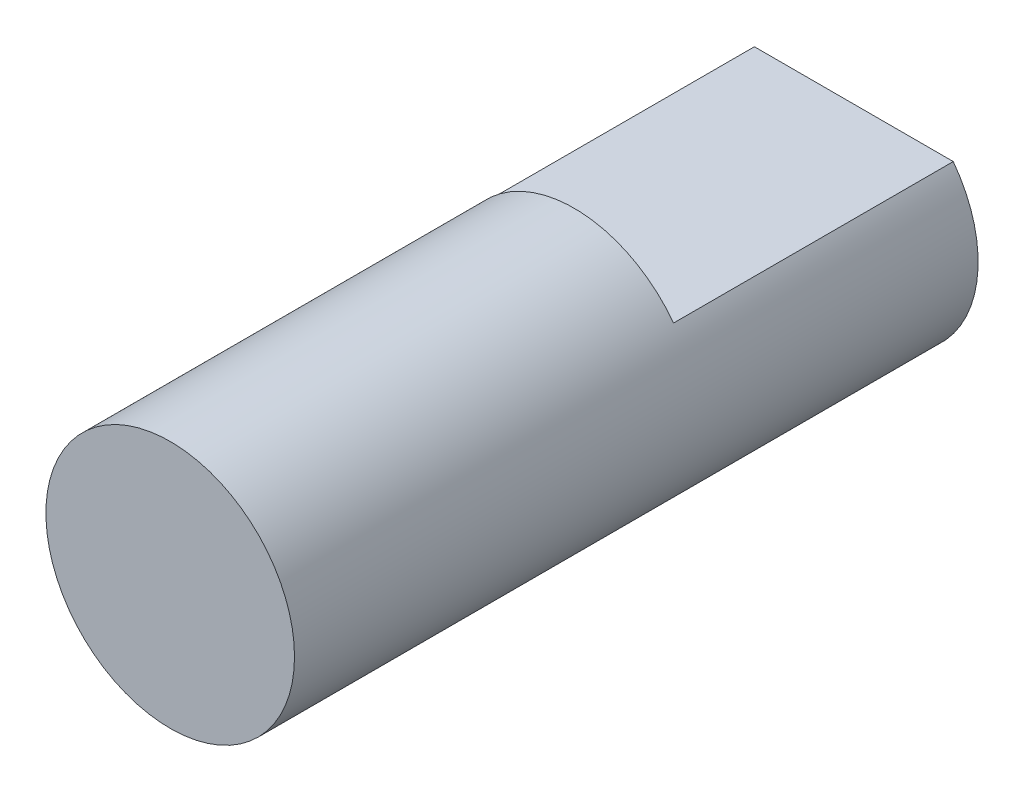
ISO-10303-21;
HEADER;
FILE_DESCRIPTION(('STEP AP214'),'2;1');
FILE_NAME('part.step','',(''),(''),'','','');
FILE_SCHEMA(('AUTOMOTIVE_DESIGN { 1 0 10303 214 1 1 1 1 }'));
ENDSEC;
DATA;
#1=APPLICATION_CONTEXT('core data for automotive mechanical design processes');
#2=APPLICATION_PROTOCOL_DEFINITION('international standard','automotive_design',2000,#1);
#3=PRODUCT_CONTEXT('',#1,'mechanical');
#4=PRODUCT('Part','Part','',(#3));
#5=PRODUCT_RELATED_PRODUCT_CATEGORY('part','',(#4));
#6=PRODUCT_DEFINITION_FORMATION('','',#4);
#7=PRODUCT_DEFINITION_CONTEXT('part definition',#1,'design');
#8=PRODUCT_DEFINITION('design','',#6,#7);
#9=PRODUCT_DEFINITION_SHAPE('','',#8);
#10=(LENGTH_UNIT() NAMED_UNIT(*) SI_UNIT(.MILLI.,.METRE.));
#11=(NAMED_UNIT(*) PLANE_ANGLE_UNIT() SI_UNIT($,.RADIAN.));
#12=(NAMED_UNIT(*) SI_UNIT($,.STERADIAN.) SOLID_ANGLE_UNIT());
#13=UNCERTAINTY_MEASURE_WITH_UNIT(LENGTH_MEASURE(1.E-05),#10,'distance_accuracy_value','');
#14=(GEOMETRIC_REPRESENTATION_CONTEXT(3) GLOBAL_UNCERTAINTY_ASSIGNED_CONTEXT((#13)) GLOBAL_UNIT_ASSIGNED_CONTEXT((#10,
#11,#12)) REPRESENTATION_CONTEXT('',''));
#15=CARTESIAN_POINT('',(0.,0.,0.));
#16=DIRECTION('',(0.,0.,1.));
#17=DIRECTION('',(1.,0.,0.));
#18=AXIS2_PLACEMENT_3D('',#15,#16,#17);
#19=CARTESIAN_POINT('',(0.,0.,11.));
#20=DIRECTION('',(0.,0.,-1.));
#21=DIRECTION('',(-1.,0.,0.));
#22=AXIS2_PLACEMENT_3D('',#19,#20,#21);
#23=CYLINDRICAL_SURFACE('',#22,4.);
#24=CARTESIAN_POINT('',(0.,0.,11.));
#25=DIRECTION('',(0.,0.,1.));
#26=DIRECTION('',(1.,0.,0.));
#27=AXIS2_PLACEMENT_3D('',#24,#25,#26);
#28=CIRCLE('',#27,4.);
#29=CARTESIAN_POINT('',(4.,0.,11.));
#30=VERTEX_POINT('',#29);
#31=EDGE_CURVE('E11',#30,#30,#28,.T.);
#32=ORIENTED_EDGE('',*,*,#31,.F.);
#33=EDGE_LOOP('',(#32));
#34=FACE_BOUND('',#33,.T.);
#35=CARTESIAN_POINT('',(0.,0.,-2.));
#36=DIRECTION('',(0.,0.,1.));
#37=DIRECTION('',(1.,0.,0.));
#38=AXIS2_PLACEMENT_3D('',#35,#36,#37);
#39=CIRCLE('',#38,4.);
#40=CARTESIAN_POINT('',(3.2,2.4,-2.));
#41=VERTEX_POINT('',#40);
#42=CARTESIAN_POINT('',(-3.2,2.4,-2.));
#43=VERTEX_POINT('',#42);
#44=EDGE_CURVE('E66',#41,#43,#39,.T.);
#45=ORIENTED_EDGE('',*,*,#44,.T.);
#46=DIRECTION('',(0.,0.,-1.));
#47=VECTOR('',#46,1.);
#48=CARTESIAN_POINT('',(-3.2,2.4,-2.));
#49=LINE('',#48,#47);
#50=CARTESIAN_POINT('',(-3.2,2.4,-11.));
#51=VERTEX_POINT('',#50);
#52=EDGE_CURVE('E73',#43,#51,#49,.T.);
#53=ORIENTED_EDGE('',*,*,#52,.T.);
#54=CARTESIAN_POINT('',(0.,0.,-11.));
#55=DIRECTION('',(0.,0.,1.));
#56=DIRECTION('',(1.,0.,0.));
#57=AXIS2_PLACEMENT_3D('',#54,#55,#56);
#58=CIRCLE('',#57,4.);
#59=CARTESIAN_POINT('',(3.2,2.4,-11.));
#60=VERTEX_POINT('',#59);
#61=EDGE_CURVE('E46',#51,#60,#58,.T.);
#62=ORIENTED_EDGE('',*,*,#61,.T.);
#63=DIRECTION('',(0.,0.,-1.));
#64=VECTOR('',#63,1.);
#65=CARTESIAN_POINT('',(3.2,2.4,-2.));
#66=LINE('',#65,#64);
#67=EDGE_CURVE('E58',#41,#60,#66,.T.);
#68=ORIENTED_EDGE('',*,*,#67,.F.);
#69=EDGE_LOOP('',(#45,#53,#62,#68));
#70=FACE_BOUND('',#69,.T.);
#71=ADVANCED_FACE('F43',(#34,#70),#23,.T.);
#72=CARTESIAN_POINT('',(0.,0.,11.));
#73=DIRECTION('',(0.,0.,1.));
#74=DIRECTION('',(1.,0.,0.));
#75=AXIS2_PLACEMENT_3D('',#72,#73,#74);
#76=PLANE('',#75);
#77=ORIENTED_EDGE('',*,*,#31,.T.);
#78=EDGE_LOOP('',(#77));
#79=FACE_BOUND('',#78,.T.);
#80=ADVANCED_FACE('F99',(#79),#76,.T.);
#81=CARTESIAN_POINT('',(0.,0.,-11.));
#82=DIRECTION('',(0.,0.,1.));
#83=DIRECTION('',(1.,0.,0.));
#84=AXIS2_PLACEMENT_3D('',#81,#82,#83);
#85=PLANE('',#84);
#86=ORIENTED_EDGE('',*,*,#61,.F.);
#87=DIRECTION('',(-1.,0.,0.));
#88=VECTOR('',#87,1.);
#89=CARTESIAN_POINT('',(3.2,2.4,-11.));
#90=LINE('',#89,#88);
#91=EDGE_CURVE('E70',#60,#51,#90,.T.);
#92=ORIENTED_EDGE('',*,*,#91,.F.);
#93=EDGE_LOOP('',(#86,#92));
#94=FACE_BOUND('',#93,.T.);
#95=ADVANCED_FACE('F83',(#94),#85,.F.);
#96=CARTESIAN_POINT('',(3.2,2.4,-2.));
#97=DIRECTION('',(0.,-1.,0.));
#98=DIRECTION('',(0.,0.,-1.));
#99=AXIS2_PLACEMENT_3D('',#96,#97,#98);
#100=PLANE('',#99);
#101=ORIENTED_EDGE('',*,*,#91,.T.);
#102=ORIENTED_EDGE('',*,*,#52,.F.);
#103=DIRECTION('',(-1.,0.,0.));
#104=VECTOR('',#103,1.);
#105=CARTESIAN_POINT('',(3.2,2.4,-2.));
#106=LINE('',#105,#104);
#107=EDGE_CURVE('E78',#41,#43,#106,.T.);
#108=ORIENTED_EDGE('',*,*,#107,.F.);
#109=ORIENTED_EDGE('',*,*,#67,.T.);
#110=EDGE_LOOP('',(#101,#102,#108,#109));
#111=FACE_BOUND('',#110,.T.);
#112=ADVANCED_FACE('F72',(#111),#100,.F.);
#113=CARTESIAN_POINT('',(0.,0.,-2.));
#114=DIRECTION('',(0.,0.,1.));
#115=DIRECTION('',(1.,0.,0.));
#116=AXIS2_PLACEMENT_3D('',#113,#114,#115);
#117=PLANE('',#116);
#118=ORIENTED_EDGE('',*,*,#107,.T.);
#119=ORIENTED_EDGE('',*,*,#44,.F.);
#120=EDGE_LOOP('',(#118,#119));
#121=FACE_BOUND('',#120,.T.);
#122=ADVANCED_FACE('F91',(#121),#117,.F.);
#123=CLOSED_SHELL('',(#71,#80,#95,#112,#122));
#124=MANIFOLD_SOLID_BREP('B2',#123);
#125=ADVANCED_BREP_SHAPE_REPRESENTATION('',(#18,#124),#14);
#126=SHAPE_DEFINITION_REPRESENTATION(#9,#125);
ENDSEC;
END-ISO-10303-21;
